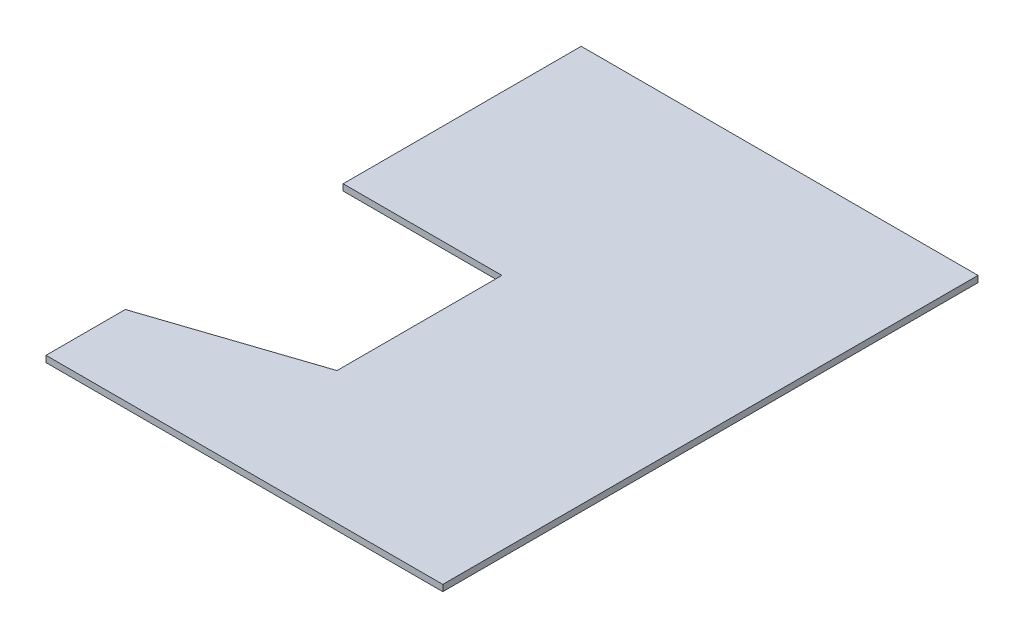
ISO-10303-21;
HEADER;
FILE_DESCRIPTION(('STEP AP214'),'2;1');
FILE_NAME('part.step','',(''),(''),'','','');
FILE_SCHEMA(('AUTOMOTIVE_DESIGN { 1 0 10303 214 1 1 1 1 }'));
ENDSEC;
DATA;
#1=APPLICATION_CONTEXT('core data for automotive mechanical design processes');
#2=APPLICATION_PROTOCOL_DEFINITION('international standard','automotive_design',2000,#1);
#3=PRODUCT_CONTEXT('',#1,'mechanical');
#4=PRODUCT('Part','Part','',(#3));
#5=PRODUCT_RELATED_PRODUCT_CATEGORY('part','',(#4));
#6=PRODUCT_DEFINITION_FORMATION('','',#4);
#7=PRODUCT_DEFINITION_CONTEXT('part definition',#1,'design');
#8=PRODUCT_DEFINITION('design','',#6,#7);
#9=PRODUCT_DEFINITION_SHAPE('','',#8);
#10=(LENGTH_UNIT() NAMED_UNIT(*) SI_UNIT(.MILLI.,.METRE.));
#11=(NAMED_UNIT(*) PLANE_ANGLE_UNIT() SI_UNIT($,.RADIAN.));
#12=(NAMED_UNIT(*) SI_UNIT($,.STERADIAN.) SOLID_ANGLE_UNIT());
#13=UNCERTAINTY_MEASURE_WITH_UNIT(LENGTH_MEASURE(1.E-05),#10,'distance_accuracy_value','');
#14=(GEOMETRIC_REPRESENTATION_CONTEXT(3) GLOBAL_UNCERTAINTY_ASSIGNED_CONTEXT((#13)) GLOBAL_UNIT_ASSIGNED_CONTEXT((#10,
#11,#12)) REPRESENTATION_CONTEXT('',''));
#15=CARTESIAN_POINT('',(0.,0.,0.));
#16=DIRECTION('',(0.,0.,1.));
#17=DIRECTION('',(1.,0.,0.));
#18=AXIS2_PLACEMENT_3D('',#15,#16,#17);
#19=CARTESIAN_POINT('',(333.727349577039,4.,-282.79792746114));
#20=DIRECTION('',(1.,0.,0.));
#21=DIRECTION('',(0.,0.,-1.));
#22=AXIS2_PLACEMENT_3D('',#19,#20,#21);
#23=PLANE('',#22);
#24=DIRECTION('',(0.,0.,1.));
#25=VECTOR('',#24,1.);
#26=CARTESIAN_POINT('',(333.727349577039,0.,-282.79792746114));
#27=LINE('',#26,#25);
#28=CARTESIAN_POINT('',(333.727349577039,0.,-282.79792746114));
#29=VERTEX_POINT('',#28);
#30=CARTESIAN_POINT('',(333.727349577039,0.,-132.79792746114));
#31=VERTEX_POINT('',#30);
#32=EDGE_CURVE('E133',#29,#31,#27,.T.);
#33=ORIENTED_EDGE('',*,*,#32,.T.);
#34=DIRECTION('',(0.,-1.,0.));
#35=VECTOR('',#34,1.);
#36=CARTESIAN_POINT('',(333.727349577039,4.,-132.79792746114));
#37=LINE('',#36,#35);
#38=CARTESIAN_POINT('',(333.727349577039,4.,-132.79792746114));
#39=VERTEX_POINT('',#38);
#40=EDGE_CURVE('E11',#39,#31,#37,.T.);
#41=ORIENTED_EDGE('',*,*,#40,.F.);
#42=DIRECTION('',(0.,0.,1.));
#43=VECTOR('',#42,1.);
#44=CARTESIAN_POINT('',(333.727349577039,4.,-282.79792746114));
#45=LINE('',#44,#43);
#46=CARTESIAN_POINT('',(333.727349577039,4.,-282.79792746114));
#47=VERTEX_POINT('',#46);
#48=EDGE_CURVE('E147',#47,#39,#45,.T.);
#49=ORIENTED_EDGE('',*,*,#48,.F.);
#50=DIRECTION('',(0.,-1.,0.));
#51=VECTOR('',#50,1.);
#52=CARTESIAN_POINT('',(333.727349577039,4.,-282.79792746114));
#53=LINE('',#52,#51);
#54=EDGE_CURVE('E129',#47,#29,#53,.T.);
#55=ORIENTED_EDGE('',*,*,#54,.T.);
#56=EDGE_LOOP('',(#33,#41,#49,#55));
#57=FACE_BOUND('',#56,.T.);
#58=ADVANCED_FACE('F37',(#57),#23,.F.);
#59=CARTESIAN_POINT('',(333.727349577039,4.,-132.79792746114));
#60=DIRECTION('',(0.,0.,-1.));
#61=DIRECTION('',(-1.,0.,0.));
#62=AXIS2_PLACEMENT_3D('',#59,#60,#61);
#63=PLANE('',#62);
#64=DIRECTION('',(1.,0.,0.));
#65=VECTOR('',#64,1.);
#66=CARTESIAN_POINT('',(333.727349577039,0.,-132.79792746114));
#67=LINE('',#66,#65);
#68=CARTESIAN_POINT('',(433.727349577039,0.,-132.79792746114));
#69=VERTEX_POINT('',#68);
#70=EDGE_CURVE('E136',#31,#69,#67,.T.);
#71=ORIENTED_EDGE('',*,*,#70,.T.);
#72=DIRECTION('',(0.,-1.,0.));
#73=VECTOR('',#72,1.);
#74=CARTESIAN_POINT('',(433.727349577039,4.,-132.79792746114));
#75=LINE('',#74,#73);
#76=CARTESIAN_POINT('',(433.727349577039,4.,-132.79792746114));
#77=VERTEX_POINT('',#76);
#78=EDGE_CURVE('E45',#77,#69,#75,.T.);
#79=ORIENTED_EDGE('',*,*,#78,.F.);
#80=DIRECTION('',(1.,0.,0.));
#81=VECTOR('',#80,1.);
#82=CARTESIAN_POINT('',(333.727349577039,4.,-132.79792746114));
#83=LINE('',#82,#81);
#84=EDGE_CURVE('E96',#39,#77,#83,.T.);
#85=ORIENTED_EDGE('',*,*,#84,.F.);
#86=ORIENTED_EDGE('',*,*,#40,.T.);
#87=EDGE_LOOP('',(#71,#79,#85,#86));
#88=FACE_BOUND('',#87,.T.);
#89=ADVANCED_FACE('F182',(#88),#63,.F.);
#90=CARTESIAN_POINT('',(433.727349577039,4.,-132.79792746114));
#91=DIRECTION('',(1.,0.,0.));
#92=DIRECTION('',(0.,0.,-1.));
#93=AXIS2_PLACEMENT_3D('',#90,#91,#92);
#94=PLANE('',#93);
#95=DIRECTION('',(0.,0.,1.));
#96=VECTOR('',#95,1.);
#97=CARTESIAN_POINT('',(433.727349577039,0.,-132.79792746114));
#98=LINE('',#97,#96);
#99=CARTESIAN_POINT('',(433.727349577039,0.,-28.9236685939119));
#100=VERTEX_POINT('',#99);
#101=EDGE_CURVE('E138',#69,#100,#98,.T.);
#102=ORIENTED_EDGE('',*,*,#101,.T.);
#103=DIRECTION('',(0.,-1.,0.));
#104=VECTOR('',#103,1.);
#105=CARTESIAN_POINT('',(433.727349577039,4.,-28.9236685939119));
#106=LINE('',#105,#104);
#107=CARTESIAN_POINT('',(433.727349577039,4.,-28.9236685939119));
#108=VERTEX_POINT('',#107);
#109=EDGE_CURVE('E154',#108,#100,#106,.T.);
#110=ORIENTED_EDGE('',*,*,#109,.F.);
#111=DIRECTION('',(0.,0.,1.));
#112=VECTOR('',#111,1.);
#113=CARTESIAN_POINT('',(433.727349577039,4.,-132.79792746114));
#114=LINE('',#113,#112);
#115=EDGE_CURVE('E162',#77,#108,#114,.T.);
#116=ORIENTED_EDGE('',*,*,#115,.F.);
#117=ORIENTED_EDGE('',*,*,#78,.T.);
#118=EDGE_LOOP('',(#102,#110,#116,#117));
#119=FACE_BOUND('',#118,.T.);
#120=ADVANCED_FACE('F160',(#119),#94,.F.);
#121=CARTESIAN_POINT('',(433.727349577039,4.,-28.9236685939119));
#122=DIRECTION('',(0.316227766016838,0.,0.948683298050514));
#123=DIRECTION('',(0.948683298050514,0.,-0.316227766016838));
#124=AXIS2_PLACEMENT_3D('',#121,#122,#123);
#125=PLANE('',#124);
#126=DIRECTION('',(-0.948683298050514,0.,0.316227766016838));
#127=VECTOR('',#126,1.);
#128=CARTESIAN_POINT('',(433.727349577039,0.,-28.9236685939119));
#129=LINE('',#128,#127);
#130=CARTESIAN_POINT('',(333.727349577039,0.,4.40966473942143));
#131=VERTEX_POINT('',#130);
#132=EDGE_CURVE('E140',#100,#131,#129,.T.);
#133=ORIENTED_EDGE('',*,*,#132,.T.);
#134=DIRECTION('',(0.,-1.,0.));
#135=VECTOR('',#134,1.);
#136=CARTESIAN_POINT('',(333.727349577039,4.,4.40966473942143));
#137=LINE('',#136,#135);
#138=CARTESIAN_POINT('',(333.727349577039,4.,4.40966473942143));
#139=VERTEX_POINT('',#138);
#140=EDGE_CURVE('E151',#139,#131,#137,.T.);
#141=ORIENTED_EDGE('',*,*,#140,.F.);
#142=DIRECTION('',(-0.948683298050514,0.,0.316227766016838));
#143=VECTOR('',#142,1.);
#144=CARTESIAN_POINT('',(433.727349577039,4.,-28.9236685939119));
#145=LINE('',#144,#143);
#146=EDGE_CURVE('E174',#108,#139,#145,.T.);
#147=ORIENTED_EDGE('',*,*,#146,.F.);
#148=ORIENTED_EDGE('',*,*,#109,.T.);
#149=EDGE_LOOP('',(#133,#141,#147,#148));
#150=FACE_BOUND('',#149,.T.);
#151=ADVANCED_FACE('F170',(#150),#125,.F.);
#152=CARTESIAN_POINT('',(333.727349577039,4.,4.40966473942143));
#153=DIRECTION('',(1.,0.,0.));
#154=DIRECTION('',(0.,0.,-1.));
#155=AXIS2_PLACEMENT_3D('',#152,#153,#154);
#156=PLANE('',#155);
#157=DIRECTION('',(0.,0.,1.));
#158=VECTOR('',#157,1.);
#159=CARTESIAN_POINT('',(333.727349577039,0.,4.40966473942143));
#160=LINE('',#159,#158);
#161=CARTESIAN_POINT('',(333.727349577039,0.,54.4096647394214));
#162=VERTEX_POINT('',#161);
#163=EDGE_CURVE('E142',#131,#162,#160,.T.);
#164=ORIENTED_EDGE('',*,*,#163,.T.);
#165=DIRECTION('',(0.,-1.,0.));
#166=VECTOR('',#165,1.);
#167=CARTESIAN_POINT('',(333.727349577039,4.,54.4096647394214));
#168=LINE('',#167,#166);
#169=CARTESIAN_POINT('',(333.727349577039,4.,54.4096647394214));
#170=VERTEX_POINT('',#169);
#171=EDGE_CURVE('E124',#170,#162,#168,.T.);
#172=ORIENTED_EDGE('',*,*,#171,.F.);
#173=DIRECTION('',(0.,0.,1.));
#174=VECTOR('',#173,1.);
#175=CARTESIAN_POINT('',(333.727349577039,4.,4.40966473942143));
#176=LINE('',#175,#174);
#177=EDGE_CURVE('E115',#139,#170,#176,.T.);
#178=ORIENTED_EDGE('',*,*,#177,.F.);
#179=ORIENTED_EDGE('',*,*,#140,.T.);
#180=EDGE_LOOP('',(#164,#172,#178,#179));
#181=FACE_BOUND('',#180,.T.);
#182=ADVANCED_FACE('F173',(#181),#156,.F.);
#183=CARTESIAN_POINT('',(333.727349577039,4.,54.4096647394214));
#184=DIRECTION('',(0.,0.,-1.));
#185=DIRECTION('',(-1.,0.,0.));
#186=AXIS2_PLACEMENT_3D('',#183,#184,#185);
#187=PLANE('',#186);
#188=DIRECTION('',(1.,0.,0.));
#189=VECTOR('',#188,1.);
#190=CARTESIAN_POINT('',(333.727349577039,0.,54.4096647394214));
#191=LINE('',#190,#189);
#192=CARTESIAN_POINT('',(583.727349577039,0.,54.4096647394214));
#193=VERTEX_POINT('',#192);
#194=EDGE_CURVE('E123',#162,#193,#191,.T.);
#195=ORIENTED_EDGE('',*,*,#194,.T.);
#196=DIRECTION('',(0.,-1.,0.));
#197=VECTOR('',#196,1.);
#198=CARTESIAN_POINT('',(583.727349577039,4.,54.4096647394214));
#199=LINE('',#198,#197);
#200=CARTESIAN_POINT('',(583.727349577039,4.,54.4096647394214));
#201=VERTEX_POINT('',#200);
#202=EDGE_CURVE('E120',#201,#193,#199,.T.);
#203=ORIENTED_EDGE('',*,*,#202,.F.);
#204=DIRECTION('',(1.,0.,0.));
#205=VECTOR('',#204,1.);
#206=CARTESIAN_POINT('',(333.727349577039,4.,54.4096647394214));
#207=LINE('',#206,#205);
#208=EDGE_CURVE('E109',#170,#201,#207,.T.);
#209=ORIENTED_EDGE('',*,*,#208,.F.);
#210=ORIENTED_EDGE('',*,*,#171,.T.);
#211=EDGE_LOOP('',(#195,#203,#209,#210));
#212=FACE_BOUND('',#211,.T.);
#213=ADVANCED_FACE('F121',(#212),#187,.F.);
#214=CARTESIAN_POINT('',(583.727349577039,4.,54.4096647394214));
#215=DIRECTION('',(-1.,0.,0.));
#216=DIRECTION('',(0.,0.,1.));
#217=AXIS2_PLACEMENT_3D('',#214,#215,#216);
#218=PLANE('',#217);
#219=DIRECTION('',(0.,0.,-1.));
#220=VECTOR('',#219,1.);
#221=CARTESIAN_POINT('',(583.727349577039,0.,54.4096647394214));
#222=LINE('',#221,#220);
#223=CARTESIAN_POINT('',(583.727349577039,0.,-282.79792746114));
#224=VERTEX_POINT('',#223);
#225=EDGE_CURVE('E82',#193,#224,#222,.T.);
#226=ORIENTED_EDGE('',*,*,#225,.T.);
#227=DIRECTION('',(0.,-1.,0.));
#228=VECTOR('',#227,1.);
#229=CARTESIAN_POINT('',(583.727349577039,4.,-282.79792746114));
#230=LINE('',#229,#228);
#231=CARTESIAN_POINT('',(583.727349577039,4.,-282.79792746114));
#232=VERTEX_POINT('',#231);
#233=EDGE_CURVE('E125',#232,#224,#230,.T.);
#234=ORIENTED_EDGE('',*,*,#233,.F.);
#235=DIRECTION('',(0.,0.,-1.));
#236=VECTOR('',#235,1.);
#237=CARTESIAN_POINT('',(583.727349577039,4.,54.4096647394214));
#238=LINE('',#237,#236);
#239=EDGE_CURVE('E113',#201,#232,#238,.T.);
#240=ORIENTED_EDGE('',*,*,#239,.F.);
#241=ORIENTED_EDGE('',*,*,#202,.T.);
#242=EDGE_LOOP('',(#226,#234,#240,#241));
#243=FACE_BOUND('',#242,.T.);
#244=ADVANCED_FACE('F127',(#243),#218,.F.);
#245=CARTESIAN_POINT('',(583.727349577039,4.,-282.79792746114));
#246=DIRECTION('',(0.,0.,1.));
#247=DIRECTION('',(1.,0.,0.));
#248=AXIS2_PLACEMENT_3D('',#245,#246,#247);
#249=PLANE('',#248);
#250=DIRECTION('',(-1.,0.,0.));
#251=VECTOR('',#250,1.);
#252=CARTESIAN_POINT('',(583.727349577039,0.,-282.79792746114));
#253=LINE('',#252,#251);
#254=EDGE_CURVE('E88',#224,#29,#253,.T.);
#255=ORIENTED_EDGE('',*,*,#254,.T.);
#256=ORIENTED_EDGE('',*,*,#54,.F.);
#257=DIRECTION('',(-1.,0.,0.));
#258=VECTOR('',#257,1.);
#259=CARTESIAN_POINT('',(583.727349577039,4.,-282.79792746114));
#260=LINE('',#259,#258);
#261=EDGE_CURVE('E53',#232,#47,#260,.T.);
#262=ORIENTED_EDGE('',*,*,#261,.F.);
#263=ORIENTED_EDGE('',*,*,#233,.T.);
#264=EDGE_LOOP('',(#255,#256,#262,#263));
#265=FACE_BOUND('',#264,.T.);
#266=ADVANCED_FACE('F198',(#265),#249,.F.);
#267=CARTESIAN_POINT('',(0.,4.,0.));
#268=DIRECTION('',(0.,1.,0.));
#269=DIRECTION('',(0.,0.,1.));
#270=AXIS2_PLACEMENT_3D('',#267,#268,#269);
#271=PLANE('',#270);
#272=ORIENTED_EDGE('',*,*,#48,.T.);
#273=ORIENTED_EDGE('',*,*,#84,.T.);
#274=ORIENTED_EDGE('',*,*,#115,.T.);
#275=ORIENTED_EDGE('',*,*,#146,.T.);
#276=ORIENTED_EDGE('',*,*,#177,.T.);
#277=ORIENTED_EDGE('',*,*,#208,.T.);
#278=ORIENTED_EDGE('',*,*,#239,.T.);
#279=ORIENTED_EDGE('',*,*,#261,.T.);
#280=EDGE_LOOP('',(#272,#273,#274,#275,#276,#277,#278,#279));
#281=FACE_BOUND('',#280,.T.);
#282=ADVANCED_FACE('F111',(#281),#271,.T.);
#283=CARTESIAN_POINT('',(0.,0.,0.));
#284=DIRECTION('',(0.,1.,0.));
#285=DIRECTION('',(0.,0.,1.));
#286=AXIS2_PLACEMENT_3D('',#283,#284,#285);
#287=PLANE('',#286);
#288=ORIENTED_EDGE('',*,*,#32,.F.);
#289=ORIENTED_EDGE('',*,*,#254,.F.);
#290=ORIENTED_EDGE('',*,*,#225,.F.);
#291=ORIENTED_EDGE('',*,*,#194,.F.);
#292=ORIENTED_EDGE('',*,*,#163,.F.);
#293=ORIENTED_EDGE('',*,*,#132,.F.);
#294=ORIENTED_EDGE('',*,*,#101,.F.);
#295=ORIENTED_EDGE('',*,*,#70,.F.);
#296=EDGE_LOOP('',(#288,#289,#290,#291,#292,#293,#294,#295));
#297=FACE_BOUND('',#296,.T.);
#298=ADVANCED_FACE('F166',(#297),#287,.F.);
#299=CLOSED_SHELL('',(#58,#89,#120,#151,#182,#213,#244,#266,#282,#298));
#300=MANIFOLD_SOLID_BREP('B2',#299);
#301=ADVANCED_BREP_SHAPE_REPRESENTATION('',(#18,#300),#14);
#302=SHAPE_DEFINITION_REPRESENTATION(#9,#301);
ENDSEC;
END-ISO-10303-21;
